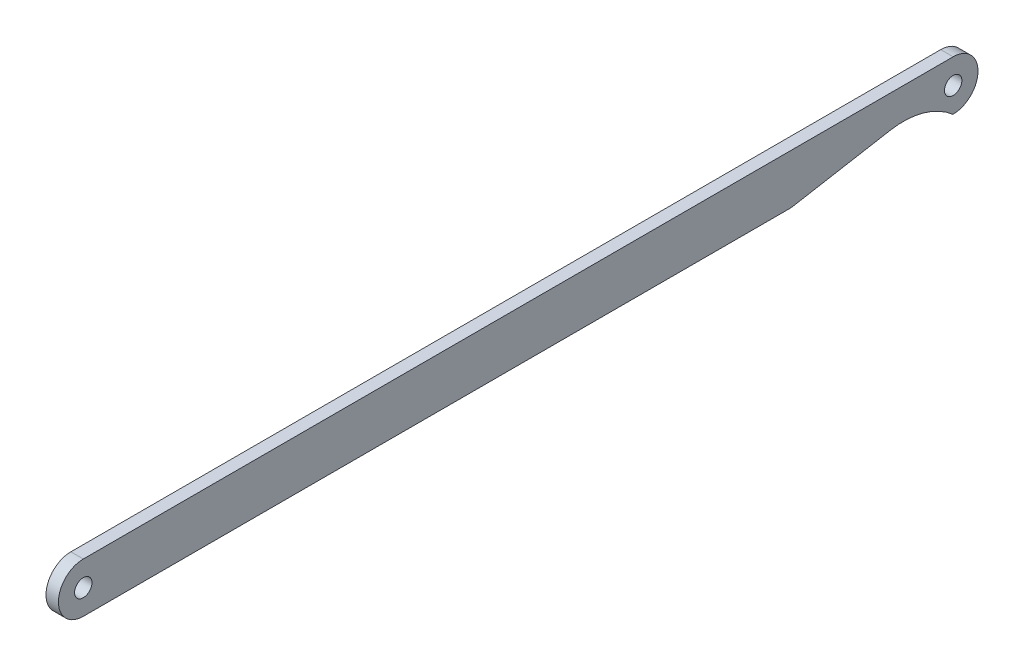
ISO-10303-21;
HEADER;
FILE_DESCRIPTION(('STEP AP214'),'2;1');
FILE_NAME('part.step','',(''),(''),'','','');
FILE_SCHEMA(('AUTOMOTIVE_DESIGN { 1 0 10303 214 1 1 1 1 }'));
ENDSEC;
DATA;
#1=APPLICATION_CONTEXT('core data for automotive mechanical design processes');
#2=APPLICATION_PROTOCOL_DEFINITION('international standard','automotive_design',2000,#1);
#3=PRODUCT_CONTEXT('',#1,'mechanical');
#4=PRODUCT('Part','Part','',(#3));
#5=PRODUCT_RELATED_PRODUCT_CATEGORY('part','',(#4));
#6=PRODUCT_DEFINITION_FORMATION('','',#4);
#7=PRODUCT_DEFINITION_CONTEXT('part definition',#1,'design');
#8=PRODUCT_DEFINITION('design','',#6,#7);
#9=PRODUCT_DEFINITION_SHAPE('','',#8);
#10=(LENGTH_UNIT() NAMED_UNIT(*) SI_UNIT(.MILLI.,.METRE.));
#11=(NAMED_UNIT(*) PLANE_ANGLE_UNIT() SI_UNIT($,.RADIAN.));
#12=(NAMED_UNIT(*) SI_UNIT($,.STERADIAN.) SOLID_ANGLE_UNIT());
#13=UNCERTAINTY_MEASURE_WITH_UNIT(LENGTH_MEASURE(1.E-05),#10,'distance_accuracy_value','');
#14=(GEOMETRIC_REPRESENTATION_CONTEXT(3) GLOBAL_UNCERTAINTY_ASSIGNED_CONTEXT((#13)) GLOBAL_UNIT_ASSIGNED_CONTEXT((#10,
#11,#12)) REPRESENTATION_CONTEXT('',''));
#15=CARTESIAN_POINT('',(0.,0.,0.));
#16=DIRECTION('',(0.,0.,1.));
#17=DIRECTION('',(1.,0.,0.));
#18=AXIS2_PLACEMENT_3D('',#15,#16,#17);
#19=CARTESIAN_POINT('',(1.,-2.00000000000001,0.));
#20=DIRECTION('',(1.,0.,0.));
#21=DIRECTION('',(0.,0.,-1.));
#22=AXIS2_PLACEMENT_3D('',#19,#20,#21);
#23=PLANE('',#22);
#24=CARTESIAN_POINT('',(1.,-2.,-70.));
#25=DIRECTION('',(1.,0.,0.));
#26=DIRECTION('',(0.,0.,-1.));
#27=AXIS2_PLACEMENT_3D('',#24,#25,#26);
#28=CIRCLE('',#27,0.700000000000002);
#29=CARTESIAN_POINT('',(1.,-2.,-70.7));
#30=VERTEX_POINT('',#29);
#31=EDGE_CURVE('E138',#30,#30,#28,.T.);
#32=ORIENTED_EDGE('',*,*,#31,.F.);
#33=EDGE_LOOP('',(#32));
#34=FACE_BOUND('',#33,.T.);
#35=CARTESIAN_POINT('',(1.,-2.00000000000001,0.));
#36=DIRECTION('',(1.,0.,0.));
#37=DIRECTION('',(0.,0.,-1.));
#38=AXIS2_PLACEMENT_3D('',#35,#36,#37);
#39=CIRCLE('',#38,0.700000000000002);
#40=CARTESIAN_POINT('',(1.,-2.00000000000001,-0.700000000000002));
#41=VERTEX_POINT('',#40);
#42=EDGE_CURVE('E144',#41,#41,#39,.T.);
#43=ORIENTED_EDGE('',*,*,#42,.F.);
#44=EDGE_LOOP('',(#43));
#45=FACE_BOUND('',#44,.T.);
#46=DIRECTION('',(0.,-0.173648177666931,0.984807753012208));
#47=VECTOR('',#46,1.);
#48=CARTESIAN_POINT('',(1.,2.18516906519879,-92.0459821601415));
#49=LINE('',#48,#47);
#50=CARTESIAN_POINT('',(1.,-2.59115348192675,-64.9581109339984));
#51=VERTEX_POINT('',#50);
#52=CARTESIAN_POINT('',(1.,-4.,-56.968145289418));
#53=VERTEX_POINT('',#52);
#54=EDGE_CURVE('E58',#51,#53,#49,.T.);
#55=ORIENTED_EDGE('',*,*,#54,.F.);
#56=CARTESIAN_POINT('',(1.,-8.5,-66.));
#57=DIRECTION('',(1.,0.,0.));
#58=DIRECTION('',(0.,0.,-1.));
#59=AXIS2_PLACEMENT_3D('',#56,#57,#58);
#60=CIRCLE('',#59,6.);
#61=CARTESIAN_POINT('',(1.,-4.,-69.9686269665969));
#62=VERTEX_POINT('',#61);
#63=EDGE_CURVE('E117',#51,#62,#60,.F.);
#64=ORIENTED_EDGE('',*,*,#63,.T.);
#65=DIRECTION('',(0.,0.,-1.));
#66=VECTOR('',#65,1.);
#67=CARTESIAN_POINT('',(1.,-4.,-70.));
#68=LINE('',#67,#66);
#69=CARTESIAN_POINT('',(1.,-4.,-70.));
#70=VERTEX_POINT('',#69);
#71=EDGE_CURVE('E152',#62,#70,#68,.T.);
#72=ORIENTED_EDGE('',*,*,#71,.T.);
#73=CARTESIAN_POINT('',(1.,-2.,-70.));
#74=DIRECTION('',(1.,0.,0.));
#75=DIRECTION('',(0.,0.,1.));
#76=AXIS2_PLACEMENT_3D('',#73,#74,#75);
#77=CIRCLE('',#76,2.);
#78=CARTESIAN_POINT('',(1.,0.,-70.));
#79=VERTEX_POINT('',#78);
#80=EDGE_CURVE('E154',#70,#79,#77,.T.);
#81=ORIENTED_EDGE('',*,*,#80,.T.);
#82=DIRECTION('',(0.,0.,1.));
#83=VECTOR('',#82,1.);
#84=CARTESIAN_POINT('',(1.,0.,0.));
#85=LINE('',#84,#83);
#86=CARTESIAN_POINT('',(1.,0.,0.));
#87=VERTEX_POINT('',#86);
#88=EDGE_CURVE('E67',#79,#87,#85,.T.);
#89=ORIENTED_EDGE('',*,*,#88,.T.);
#90=CARTESIAN_POINT('',(1.,-2.00000000000001,0.));
#91=DIRECTION('',(1.,0.,0.));
#92=DIRECTION('',(0.,0.,-1.));
#93=AXIS2_PLACEMENT_3D('',#90,#91,#92);
#94=CIRCLE('',#93,2.);
#95=CARTESIAN_POINT('',(1.,-4.,0.));
#96=VERTEX_POINT('',#95);
#97=EDGE_CURVE('E150',#87,#96,#94,.T.);
#98=ORIENTED_EDGE('',*,*,#97,.T.);
#99=EDGE_CURVE('E94',#96,#53,#68,.T.);
#100=ORIENTED_EDGE('',*,*,#99,.T.);
#101=EDGE_LOOP('',(#55,#64,#72,#81,#89,#98,#100));
#102=FACE_BOUND('',#101,.T.);
#103=ADVANCED_FACE('F43',(#34,#45,#102),#23,.T.);
#104=CARTESIAN_POINT('',(0.,-2.00000000000001,0.));
#105=DIRECTION('',(1.,0.,0.));
#106=DIRECTION('',(0.,0.,-1.));
#107=AXIS2_PLACEMENT_3D('',#104,#105,#106);
#108=PLANE('',#107);
#109=CARTESIAN_POINT('',(0.,-2.,-70.));
#110=DIRECTION('',(1.,0.,0.));
#111=DIRECTION('',(0.,0.,-1.));
#112=AXIS2_PLACEMENT_3D('',#109,#110,#111);
#113=CIRCLE('',#112,0.700000000000002);
#114=CARTESIAN_POINT('',(0.,-2.,-70.7));
#115=VERTEX_POINT('',#114);
#116=EDGE_CURVE('E136',#115,#115,#113,.T.);
#117=ORIENTED_EDGE('',*,*,#116,.T.);
#118=EDGE_LOOP('',(#117));
#119=FACE_BOUND('',#118,.T.);
#120=CARTESIAN_POINT('',(0.,-2.00000000000001,0.));
#121=DIRECTION('',(1.,0.,0.));
#122=DIRECTION('',(0.,0.,-1.));
#123=AXIS2_PLACEMENT_3D('',#120,#121,#122);
#124=CIRCLE('',#123,0.700000000000002);
#125=CARTESIAN_POINT('',(0.,-2.00000000000001,-0.700000000000002));
#126=VERTEX_POINT('',#125);
#127=EDGE_CURVE('E141',#126,#126,#124,.T.);
#128=ORIENTED_EDGE('',*,*,#127,.T.);
#129=EDGE_LOOP('',(#128));
#130=FACE_BOUND('',#129,.T.);
#131=CARTESIAN_POINT('',(0.,-8.5,-66.));
#132=DIRECTION('',(1.,0.,0.));
#133=DIRECTION('',(0.,0.,-1.));
#134=AXIS2_PLACEMENT_3D('',#131,#132,#133);
#135=CIRCLE('',#134,6.);
#136=CARTESIAN_POINT('',(0.,-2.59115348192675,-64.9581109339984));
#137=VERTEX_POINT('',#136);
#138=CARTESIAN_POINT('',(0.,-4.,-69.9686269665969));
#139=VERTEX_POINT('',#138);
#140=EDGE_CURVE('E114',#137,#139,#135,.F.);
#141=ORIENTED_EDGE('',*,*,#140,.F.);
#142=DIRECTION('',(0.,-0.173648177666931,0.984807753012208));
#143=VECTOR('',#142,1.);
#144=CARTESIAN_POINT('',(0.,2.18516906519879,-92.0459821601415));
#145=LINE('',#144,#143);
#146=CARTESIAN_POINT('',(0.,-4.,-56.968145289418));
#147=VERTEX_POINT('',#146);
#148=EDGE_CURVE('E119',#137,#147,#145,.T.);
#149=ORIENTED_EDGE('',*,*,#148,.T.);
#150=DIRECTION('',(0.,0.,-1.));
#151=VECTOR('',#150,1.);
#152=CARTESIAN_POINT('',(0.,-4.,-70.));
#153=LINE('',#152,#151);
#154=CARTESIAN_POINT('',(0.,-4.,0.));
#155=VERTEX_POINT('',#154);
#156=EDGE_CURVE('E160',#155,#147,#153,.T.);
#157=ORIENTED_EDGE('',*,*,#156,.F.);
#158=CARTESIAN_POINT('',(0.,-2.00000000000001,0.));
#159=DIRECTION('',(1.,0.,0.));
#160=DIRECTION('',(0.,0.,-1.));
#161=AXIS2_PLACEMENT_3D('',#158,#159,#160);
#162=CIRCLE('',#161,2.);
#163=CARTESIAN_POINT('',(0.,0.,0.));
#164=VERTEX_POINT('',#163);
#165=EDGE_CURVE('E147',#164,#155,#162,.T.);
#166=ORIENTED_EDGE('',*,*,#165,.F.);
#167=DIRECTION('',(0.,0.,1.));
#168=VECTOR('',#167,1.);
#169=CARTESIAN_POINT('',(0.,0.,0.));
#170=LINE('',#169,#168);
#171=CARTESIAN_POINT('',(0.,0.,-70.));
#172=VERTEX_POINT('',#171);
#173=EDGE_CURVE('E88',#172,#164,#170,.T.);
#174=ORIENTED_EDGE('',*,*,#173,.F.);
#175=CARTESIAN_POINT('',(0.,-2.,-70.));
#176=DIRECTION('',(1.,0.,0.));
#177=DIRECTION('',(0.,0.,1.));
#178=AXIS2_PLACEMENT_3D('',#175,#176,#177);
#179=CIRCLE('',#178,2.);
#180=CARTESIAN_POINT('',(0.,-4.,-70.));
#181=VERTEX_POINT('',#180);
#182=EDGE_CURVE('E162',#181,#172,#179,.T.);
#183=ORIENTED_EDGE('',*,*,#182,.F.);
#184=EDGE_CURVE('E129',#139,#181,#153,.T.);
#185=ORIENTED_EDGE('',*,*,#184,.F.);
#186=EDGE_LOOP('',(#141,#149,#157,#166,#174,#183,#185));
#187=FACE_BOUND('',#186,.T.);
#188=ADVANCED_FACE('F127',(#119,#130,#187),#108,.F.);
#189=CARTESIAN_POINT('',(1.,-4.,-70.));
#190=DIRECTION('',(0.,1.,0.));
#191=DIRECTION('',(0.,0.,1.));
#192=AXIS2_PLACEMENT_3D('',#189,#190,#191);
#193=PLANE('',#192);
#194=DIRECTION('',(1.,0.,0.));
#195=VECTOR('',#194,1.);
#196=CARTESIAN_POINT('',(0.,-4.,-69.9686269665969));
#197=LINE('',#196,#195);
#198=EDGE_CURVE('E134',#139,#62,#197,.T.);
#199=ORIENTED_EDGE('',*,*,#198,.F.);
#200=ORIENTED_EDGE('',*,*,#184,.T.);
#201=DIRECTION('',(-1.,0.,0.));
#202=VECTOR('',#201,1.);
#203=CARTESIAN_POINT('',(1.,-4.,-70.));
#204=LINE('',#203,#202);
#205=EDGE_CURVE('E51',#70,#181,#204,.T.);
#206=ORIENTED_EDGE('',*,*,#205,.F.);
#207=ORIENTED_EDGE('',*,*,#71,.F.);
#208=EDGE_LOOP('',(#199,#200,#206,#207));
#209=FACE_BOUND('',#208,.T.);
#210=ADVANCED_FACE('F199',(#209),#193,.F.);
#211=CARTESIAN_POINT('',(1.,-2.00000000000001,0.));
#212=DIRECTION('',(-1.,0.,0.));
#213=DIRECTION('',(0.,0.,1.));
#214=AXIS2_PLACEMENT_3D('',#211,#212,#213);
#215=CYLINDRICAL_SURFACE('',#214,2.);
#216=ORIENTED_EDGE('',*,*,#165,.T.);
#217=DIRECTION('',(-1.,0.,0.));
#218=VECTOR('',#217,1.);
#219=CARTESIAN_POINT('',(1.,-4.,0.));
#220=LINE('',#219,#218);
#221=EDGE_CURVE('E13',#96,#155,#220,.T.);
#222=ORIENTED_EDGE('',*,*,#221,.F.);
#223=ORIENTED_EDGE('',*,*,#97,.F.);
#224=DIRECTION('',(-1.,0.,0.));
#225=VECTOR('',#224,1.);
#226=CARTESIAN_POINT('',(1.,0.,0.));
#227=LINE('',#226,#225);
#228=EDGE_CURVE('E157',#87,#164,#227,.T.);
#229=ORIENTED_EDGE('',*,*,#228,.T.);
#230=EDGE_LOOP('',(#216,#222,#223,#229));
#231=FACE_BOUND('',#230,.T.);
#232=ADVANCED_FACE('F45',(#231),#215,.T.);
#233=ORIENTED_EDGE('',*,*,#156,.T.);
#234=DIRECTION('',(1.,0.,0.));
#235=VECTOR('',#234,1.);
#236=CARTESIAN_POINT('',(0.,-4.,-56.968145289418));
#237=LINE('',#236,#235);
#238=EDGE_CURVE('E118',#147,#53,#237,.T.);
#239=ORIENTED_EDGE('',*,*,#238,.T.);
#240=ORIENTED_EDGE('',*,*,#99,.F.);
#241=ORIENTED_EDGE('',*,*,#221,.T.);
#242=EDGE_LOOP('',(#233,#239,#240,#241));
#243=FACE_BOUND('',#242,.T.);
#244=ADVANCED_FACE('F190',(#243),#193,.F.);
#245=CARTESIAN_POINT('',(1.,-2.,-70.));
#246=DIRECTION('',(-1.,0.,0.));
#247=DIRECTION('',(0.,0.,1.));
#248=AXIS2_PLACEMENT_3D('',#245,#246,#247);
#249=CYLINDRICAL_SURFACE('',#248,2.);
#250=ORIENTED_EDGE('',*,*,#182,.T.);
#251=DIRECTION('',(-1.,0.,0.));
#252=VECTOR('',#251,1.);
#253=CARTESIAN_POINT('',(1.,0.,-70.));
#254=LINE('',#253,#252);
#255=EDGE_CURVE('E166',#79,#172,#254,.T.);
#256=ORIENTED_EDGE('',*,*,#255,.F.);
#257=ORIENTED_EDGE('',*,*,#80,.F.);
#258=ORIENTED_EDGE('',*,*,#205,.T.);
#259=EDGE_LOOP('',(#250,#256,#257,#258));
#260=FACE_BOUND('',#259,.T.);
#261=ADVANCED_FACE('F171',(#260),#249,.T.);
#262=CARTESIAN_POINT('',(1.,0.,0.));
#263=DIRECTION('',(0.,-1.,0.));
#264=DIRECTION('',(0.,0.,-1.));
#265=AXIS2_PLACEMENT_3D('',#262,#263,#264);
#266=PLANE('',#265);
#267=ORIENTED_EDGE('',*,*,#173,.T.);
#268=ORIENTED_EDGE('',*,*,#228,.F.);
#269=ORIENTED_EDGE('',*,*,#88,.F.);
#270=ORIENTED_EDGE('',*,*,#255,.T.);
#271=EDGE_LOOP('',(#267,#268,#269,#270));
#272=FACE_BOUND('',#271,.T.);
#273=ADVANCED_FACE('F179',(#272),#266,.F.);
#274=CARTESIAN_POINT('',(1.,-2.00000000000001,0.));
#275=DIRECTION('',(-1.,0.,0.));
#276=DIRECTION('',(0.,0.,1.));
#277=AXIS2_PLACEMENT_3D('',#274,#275,#276);
#278=CYLINDRICAL_SURFACE('',#277,0.700000000000002);
#279=ORIENTED_EDGE('',*,*,#42,.T.);
#280=EDGE_LOOP('',(#279));
#281=FACE_BOUND('',#280,.T.);
#282=ORIENTED_EDGE('',*,*,#127,.F.);
#283=EDGE_LOOP('',(#282));
#284=FACE_BOUND('',#283,.T.);
#285=ADVANCED_FACE('F181',(#281,#284),#278,.F.);
#286=CARTESIAN_POINT('',(1.,-2.,-70.));
#287=DIRECTION('',(-1.,0.,0.));
#288=DIRECTION('',(0.,0.,1.));
#289=AXIS2_PLACEMENT_3D('',#286,#287,#288);
#290=CYLINDRICAL_SURFACE('',#289,0.700000000000002);
#291=ORIENTED_EDGE('',*,*,#31,.T.);
#292=EDGE_LOOP('',(#291));
#293=FACE_BOUND('',#292,.T.);
#294=ORIENTED_EDGE('',*,*,#116,.F.);
#295=EDGE_LOOP('',(#294));
#296=FACE_BOUND('',#295,.T.);
#297=ADVANCED_FACE('F187',(#293,#296),#290,.F.);
#298=CARTESIAN_POINT('',(0.,-8.5,-66.));
#299=DIRECTION('',(1.,0.,0.));
#300=DIRECTION('',(0.,0.,-1.));
#301=AXIS2_PLACEMENT_3D('',#298,#299,#300);
#302=CYLINDRICAL_SURFACE('',#301,6.);
#303=ORIENTED_EDGE('',*,*,#63,.F.);
#304=DIRECTION('',(1.,0.,0.));
#305=VECTOR('',#304,1.);
#306=CARTESIAN_POINT('',(0.,-2.59115348192675,-64.9581109339984));
#307=LINE('',#306,#305);
#308=EDGE_CURVE('E110',#137,#51,#307,.T.);
#309=ORIENTED_EDGE('',*,*,#308,.F.);
#310=ORIENTED_EDGE('',*,*,#140,.T.);
#311=ORIENTED_EDGE('',*,*,#198,.T.);
#312=EDGE_LOOP('',(#303,#309,#310,#311));
#313=FACE_BOUND('',#312,.T.);
#314=ADVANCED_FACE('F112',(#313),#302,.F.);
#315=CARTESIAN_POINT('',(0.,2.18516906519879,-92.0459821601415));
#316=DIRECTION('',(0.,0.984807753012208,0.173648177666931));
#317=DIRECTION('',(0.,-0.173648177666931,0.984807753012208));
#318=AXIS2_PLACEMENT_3D('',#315,#316,#317);
#319=PLANE('',#318);
#320=ORIENTED_EDGE('',*,*,#54,.T.);
#321=ORIENTED_EDGE('',*,*,#238,.F.);
#322=ORIENTED_EDGE('',*,*,#148,.F.);
#323=ORIENTED_EDGE('',*,*,#308,.T.);
#324=EDGE_LOOP('',(#320,#321,#322,#323));
#325=FACE_BOUND('',#324,.T.);
#326=ADVANCED_FACE('F122',(#325),#319,.F.);
#327=CLOSED_SHELL('',(#103,#188,#210,#232,#244,#261,#273,#285,#297,#314,#326));
#328=MANIFOLD_SOLID_BREP('B2',#327);
#329=ADVANCED_BREP_SHAPE_REPRESENTATION('',(#18,#328),#14);
#330=SHAPE_DEFINITION_REPRESENTATION(#9,#329);
ENDSEC;
END-ISO-10303-21;
